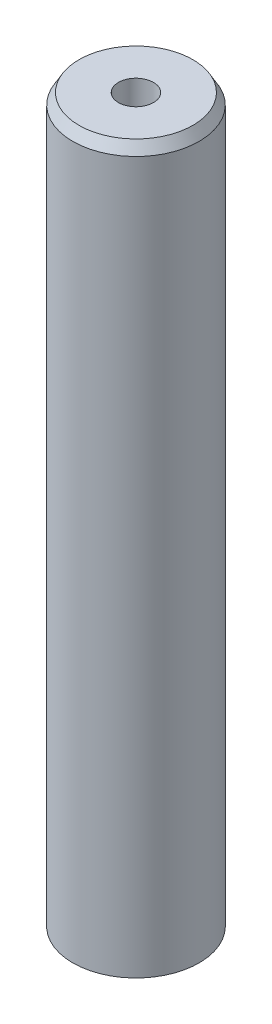
ISO-10303-21;
HEADER;
FILE_DESCRIPTION(('STEP AP214'),'2;1');
FILE_NAME('part.step','',(''),(''),'','','');
FILE_SCHEMA(('AUTOMOTIVE_DESIGN { 1 0 10303 214 1 1 1 1 }'));
ENDSEC;
DATA;
#1=APPLICATION_CONTEXT('core data for automotive mechanical design processes');
#2=APPLICATION_PROTOCOL_DEFINITION('international standard','automotive_design',2000,#1);
#3=PRODUCT_CONTEXT('',#1,'mechanical');
#4=PRODUCT('Part','Part','',(#3));
#5=PRODUCT_RELATED_PRODUCT_CATEGORY('part','',(#4));
#6=PRODUCT_DEFINITION_FORMATION('','',#4);
#7=PRODUCT_DEFINITION_CONTEXT('part definition',#1,'design');
#8=PRODUCT_DEFINITION('design','',#6,#7);
#9=PRODUCT_DEFINITION_SHAPE('','',#8);
#10=(LENGTH_UNIT() NAMED_UNIT(*) SI_UNIT(.MILLI.,.METRE.));
#11=(NAMED_UNIT(*) PLANE_ANGLE_UNIT() SI_UNIT($,.RADIAN.));
#12=(NAMED_UNIT(*) SI_UNIT($,.STERADIAN.) SOLID_ANGLE_UNIT());
#13=UNCERTAINTY_MEASURE_WITH_UNIT(LENGTH_MEASURE(1.E-05),#10,'distance_accuracy_value','');
#14=(GEOMETRIC_REPRESENTATION_CONTEXT(3) GLOBAL_UNCERTAINTY_ASSIGNED_CONTEXT((#13)) GLOBAL_UNIT_ASSIGNED_CONTEXT((#10,
#11,#12)) REPRESENTATION_CONTEXT('',''));
#15=CARTESIAN_POINT('',(0.,0.,0.));
#16=DIRECTION('',(0.,0.,1.));
#17=DIRECTION('',(1.,0.,0.));
#18=AXIS2_PLACEMENT_3D('',#15,#16,#17);
#19=CARTESIAN_POINT('',(0.,86.4882694810263,0.));
#20=DIRECTION('',(0.,-1.,0.));
#21=DIRECTION('',(0.,0.,-1.));
#22=AXIS2_PLACEMENT_3D('',#19,#20,#21);
#23=CYLINDRICAL_SURFACE('',#22,7.5);
#24=CARTESIAN_POINT('',(0.,85.2074759804782,0.));
#25=DIRECTION('',(0.,1.,0.));
#26=DIRECTION('',(0.,0.,1.));
#27=AXIS2_PLACEMENT_3D('',#24,#25,#26);
#28=CIRCLE('',#27,7.5);
#29=CARTESIAN_POINT('',(0.,85.2074759804782,7.5));
#30=VERTEX_POINT('',#29);
#31=EDGE_CURVE('E50',#30,#30,#28,.F.);
#32=ORIENTED_EDGE('',*,*,#31,.T.);
#33=EDGE_LOOP('',(#32));
#34=FACE_BOUND('',#33,.T.);
#35=CARTESIAN_POINT('',(0.,0.739466472317735,0.));
#36=DIRECTION('',(0.,1.,0.));
#37=DIRECTION('',(0.,0.,1.));
#38=AXIS2_PLACEMENT_3D('',#35,#36,#37);
#39=CIRCLE('',#38,7.5);
#40=CARTESIAN_POINT('',(0.,0.739466472317735,7.5));
#41=VERTEX_POINT('',#40);
#42=EDGE_CURVE('E51',#41,#41,#39,.T.);
#43=ORIENTED_EDGE('',*,*,#42,.T.);
#44=EDGE_LOOP('',(#43));
#45=FACE_BOUND('',#44,.T.);
#46=ADVANCED_FACE('F39',(#34,#45),#23,.T.);
#47=CARTESIAN_POINT('',(0.,86.4882694810263,0.));
#48=DIRECTION('',(0.,1.,0.));
#49=DIRECTION('',(0.,0.,1.));
#50=AXIS2_PLACEMENT_3D('',#47,#48,#49);
#51=PLANE('',#50);
#52=CARTESIAN_POINT('',(0.,86.4882694810263,0.));
#53=DIRECTION('',(0.,1.,0.));
#54=DIRECTION('',(0.,0.,1.));
#55=AXIS2_PLACEMENT_3D('',#52,#53,#54);
#56=CIRCLE('',#55,6.76053352768224);
#57=CARTESIAN_POINT('',(0.,86.4882694810263,6.76053352768224));
#58=VERTEX_POINT('',#57);
#59=EDGE_CURVE('E54',#58,#58,#56,.T.);
#60=ORIENTED_EDGE('',*,*,#59,.T.);
#61=EDGE_LOOP('',(#60));
#62=FACE_BOUND('',#61,.T.);
#63=CARTESIAN_POINT('',(0.,86.4882694810263,0.));
#64=DIRECTION('',(0.,1.,0.));
#65=DIRECTION('',(0.,0.,1.));
#66=AXIS2_PLACEMENT_3D('',#63,#64,#65);
#67=CIRCLE('',#66,2.07924420681354);
#68=CARTESIAN_POINT('',(0.,86.4882694810263,2.07924420681354));
#69=VERTEX_POINT('',#68);
#70=EDGE_CURVE('E58',#69,#69,#67,.T.);
#71=ORIENTED_EDGE('',*,*,#70,.F.);
#72=EDGE_LOOP('',(#71));
#73=FACE_BOUND('',#72,.T.);
#74=ADVANCED_FACE('F69',(#62,#73),#51,.T.);
#75=CARTESIAN_POINT('',(0.,0.,0.));
#76=DIRECTION('',(0.,1.,0.));
#77=DIRECTION('',(0.,0.,1.));
#78=AXIS2_PLACEMENT_3D('',#75,#76,#77);
#79=PLANE('',#78);
#80=CARTESIAN_POINT('',(0.,0.,0.));
#81=DIRECTION('',(0.,1.,0.));
#82=DIRECTION('',(0.,0.,1.));
#83=AXIS2_PLACEMENT_3D('',#80,#81,#82);
#84=CIRCLE('',#83,6.21920649945194);
#85=CARTESIAN_POINT('',(0.,0.,6.21920649945194));
#86=VERTEX_POINT('',#85);
#87=EDGE_CURVE('E10',#86,#86,#84,.F.);
#88=ORIENTED_EDGE('',*,*,#87,.T.);
#89=EDGE_LOOP('',(#88));
#90=FACE_BOUND('',#89,.T.);
#91=CARTESIAN_POINT('',(0.,0.,0.));
#92=DIRECTION('',(0.,1.,0.));
#93=DIRECTION('',(0.,0.,1.));
#94=AXIS2_PLACEMENT_3D('',#91,#92,#93);
#95=CIRCLE('',#94,2.07924420681354);
#96=CARTESIAN_POINT('',(0.,0.,2.07924420681354));
#97=VERTEX_POINT('',#96);
#98=EDGE_CURVE('E63',#97,#97,#95,.T.);
#99=ORIENTED_EDGE('',*,*,#98,.T.);
#100=EDGE_LOOP('',(#99));
#101=FACE_BOUND('',#100,.T.);
#102=ADVANCED_FACE('F75',(#90,#101),#79,.F.);
#103=CARTESIAN_POINT('',(0.,86.4882694810263,0.));
#104=DIRECTION('',(0.,-1.,0.));
#105=DIRECTION('',(0.,0.,-1.));
#106=AXIS2_PLACEMENT_3D('',#103,#104,#105);
#107=CYLINDRICAL_SURFACE('',#106,2.07924420681354);
#108=ORIENTED_EDGE('',*,*,#70,.T.);
#109=EDGE_LOOP('',(#108));
#110=FACE_BOUND('',#109,.T.);
#111=ORIENTED_EDGE('',*,*,#98,.F.);
#112=EDGE_LOOP('',(#111));
#113=FACE_BOUND('',#112,.T.);
#114=ADVANCED_FACE('F70',(#110,#113),#107,.F.);
#115=CARTESIAN_POINT('',(0.,86.4882694810263,0.));
#116=DIRECTION('',(0.,-1.,0.));
#117=DIRECTION('',(0.,0.,-1.));
#118=AXIS2_PLACEMENT_3D('',#115,#116,#117);
#119=CONICAL_SURFACE('',#118,6.76053352768224,0.523598775598294);
#120=ORIENTED_EDGE('',*,*,#31,.F.);
#121=EDGE_LOOP('',(#120));
#122=FACE_BOUND('',#121,.T.);
#123=ORIENTED_EDGE('',*,*,#59,.F.);
#124=EDGE_LOOP('',(#123));
#125=FACE_BOUND('',#124,.T.);
#126=ADVANCED_FACE('F81',(#122,#125),#119,.T.);
#127=CARTESIAN_POINT('',(0.,0.739466472317735,0.));
#128=DIRECTION('',(0.,1.,0.));
#129=DIRECTION('',(0.,0.,1.));
#130=AXIS2_PLACEMENT_3D('',#127,#128,#129);
#131=CONICAL_SURFACE('',#130,7.5,1.0471975511966);
#132=ORIENTED_EDGE('',*,*,#87,.F.);
#133=EDGE_LOOP('',(#132));
#134=FACE_BOUND('',#133,.T.);
#135=ORIENTED_EDGE('',*,*,#42,.F.);
#136=EDGE_LOOP('',(#135));
#137=FACE_BOUND('',#136,.T.);
#138=ADVANCED_FACE('F45',(#134,#137),#131,.T.);
#139=CLOSED_SHELL('',(#46,#74,#102,#114,#126,#138));
#140=MANIFOLD_SOLID_BREP('B2',#139);
#141=ADVANCED_BREP_SHAPE_REPRESENTATION('',(#18,#140),#14);
#142=SHAPE_DEFINITION_REPRESENTATION(#9,#141);
ENDSEC;
END-ISO-10303-21;
